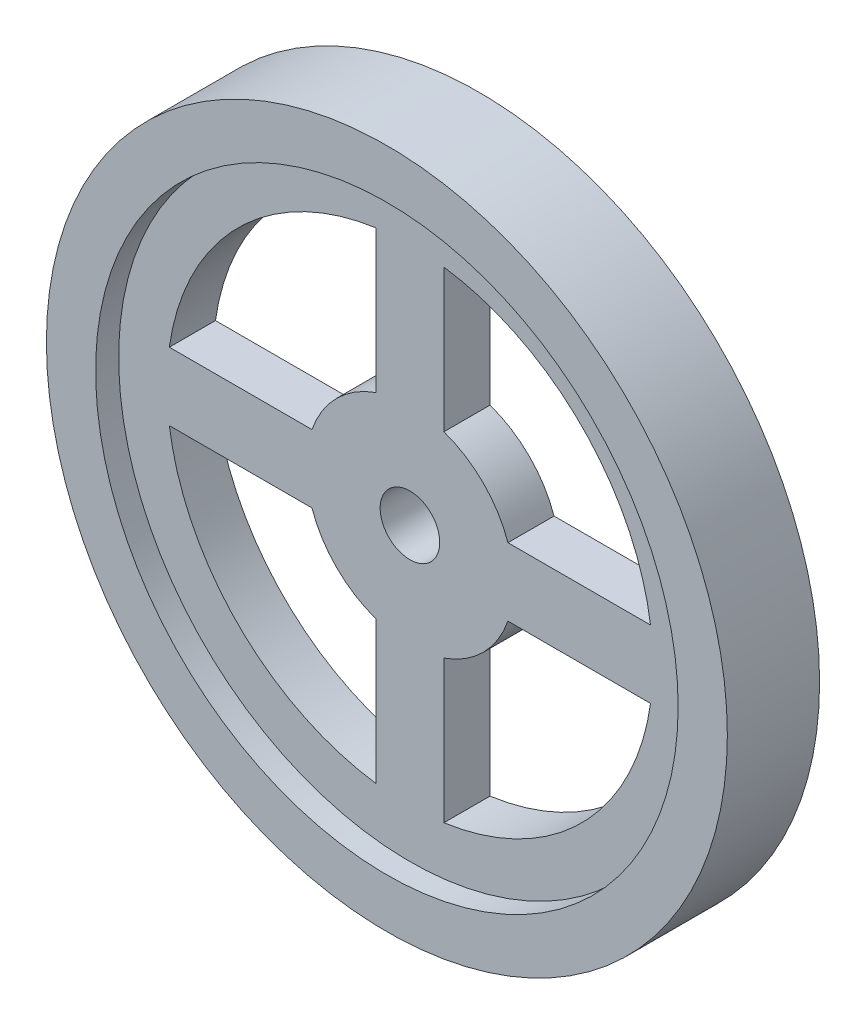
ISO-10303-21;
HEADER;
FILE_DESCRIPTION(('STEP AP214'),'2;1');
FILE_NAME('part.step','',(''),(''),'','','');
FILE_SCHEMA(('AUTOMOTIVE_DESIGN { 1 0 10303 214 1 1 1 1 }'));
ENDSEC;
DATA;
#1=APPLICATION_CONTEXT('core data for automotive mechanical design processes');
#2=APPLICATION_PROTOCOL_DEFINITION('international standard','automotive_design',2000,#1);
#3=PRODUCT_CONTEXT('',#1,'mechanical');
#4=PRODUCT('Part','Part','',(#3));
#5=PRODUCT_RELATED_PRODUCT_CATEGORY('part','',(#4));
#6=PRODUCT_DEFINITION_FORMATION('','',#4);
#7=PRODUCT_DEFINITION_CONTEXT('part definition',#1,'design');
#8=PRODUCT_DEFINITION('design','',#6,#7);
#9=PRODUCT_DEFINITION_SHAPE('','',#8);
#10=(LENGTH_UNIT() NAMED_UNIT(*) SI_UNIT(.MILLI.,.METRE.));
#11=(NAMED_UNIT(*) PLANE_ANGLE_UNIT() SI_UNIT($,.RADIAN.));
#12=(NAMED_UNIT(*) SI_UNIT($,.STERADIAN.) SOLID_ANGLE_UNIT());
#13=UNCERTAINTY_MEASURE_WITH_UNIT(LENGTH_MEASURE(1.E-05),#10,'distance_accuracy_value','');
#14=(GEOMETRIC_REPRESENTATION_CONTEXT(3) GLOBAL_UNCERTAINTY_ASSIGNED_CONTEXT((#13)) GLOBAL_UNIT_ASSIGNED_CONTEXT((#10,
#11,#12)) REPRESENTATION_CONTEXT('',''));
#15=CARTESIAN_POINT('',(0.,0.,0.));
#16=DIRECTION('',(0.,0.,1.));
#17=DIRECTION('',(1.,0.,0.));
#18=AXIS2_PLACEMENT_3D('',#15,#16,#17);
#19=CARTESIAN_POINT('',(0.,0.,0.));
#20=DIRECTION('',(0.,0.,1.));
#21=DIRECTION('',(1.,0.,0.));
#22=AXIS2_PLACEMENT_3D('',#19,#20,#21);
#23=CYLINDRICAL_SURFACE('',#22,32.0812159158557);
#24=CARTESIAN_POINT('',(0.,0.,0.));
#25=DIRECTION('',(0.,0.,1.));
#26=DIRECTION('',(1.,0.,0.));
#27=AXIS2_PLACEMENT_3D('',#24,#25,#26);
#28=CIRCLE('',#27,32.0812159158557);
#29=CARTESIAN_POINT('',(32.0812159158557,0.,0.));
#30=VERTEX_POINT('',#29);
#31=EDGE_CURVE('E240',#30,#30,#28,.T.);
#32=ORIENTED_EDGE('',*,*,#31,.F.);
#33=EDGE_LOOP('',(#32));
#34=FACE_BOUND('',#33,.T.);
#35=CARTESIAN_POINT('',(0.,0.,2.54));
#36=DIRECTION('',(0.,0.,1.));
#37=DIRECTION('',(1.,0.,0.));
#38=AXIS2_PLACEMENT_3D('',#35,#36,#37);
#39=CIRCLE('',#38,32.0812159158557);
#40=CARTESIAN_POINT('',(32.0812159158557,0.,2.54));
#41=VERTEX_POINT('',#40);
#42=EDGE_CURVE('E249',#41,#41,#39,.F.);
#43=ORIENTED_EDGE('',*,*,#42,.F.);
#44=EDGE_LOOP('',(#43));
#45=FACE_BOUND('',#44,.T.);
#46=ADVANCED_FACE('F34',(#34,#45),#23,.F.);
#47=CARTESIAN_POINT('',(0.,0.,10.16));
#48=DIRECTION('',(0.,0.,-1.));
#49=DIRECTION('',(-1.,0.,0.));
#50=AXIS2_PLACEMENT_3D('',#47,#48,#49);
#51=CYLINDRICAL_SURFACE('',#50,37.5);
#52=CARTESIAN_POINT('',(0.,0.,10.16));
#53=DIRECTION('',(0.,0.,1.));
#54=DIRECTION('',(1.,0.,0.));
#55=AXIS2_PLACEMENT_3D('',#52,#53,#54);
#56=CIRCLE('',#55,37.5);
#57=CARTESIAN_POINT('',(37.5,0.,10.16));
#58=VERTEX_POINT('',#57);
#59=EDGE_CURVE('E246',#58,#58,#56,.T.);
#60=ORIENTED_EDGE('',*,*,#59,.F.);
#61=EDGE_LOOP('',(#60));
#62=FACE_BOUND('',#61,.T.);
#63=CARTESIAN_POINT('',(0.,0.,0.));
#64=DIRECTION('',(0.,0.,1.));
#65=DIRECTION('',(1.,0.,0.));
#66=AXIS2_PLACEMENT_3D('',#63,#64,#65);
#67=CIRCLE('',#66,37.5);
#68=CARTESIAN_POINT('',(37.5,0.,0.));
#69=VERTEX_POINT('',#68);
#70=EDGE_CURVE('E243',#69,#69,#67,.T.);
#71=ORIENTED_EDGE('',*,*,#70,.T.);
#72=EDGE_LOOP('',(#71));
#73=FACE_BOUND('',#72,.T.);
#74=ADVANCED_FACE('F36',(#62,#73),#51,.T.);
#75=CARTESIAN_POINT('',(0.,0.,10.16));
#76=DIRECTION('',(0.,0.,1.));
#77=DIRECTION('',(1.,0.,0.));
#78=AXIS2_PLACEMENT_3D('',#75,#76,#77);
#79=PLANE('',#78);
#80=CARTESIAN_POINT('',(0.,0.,10.16));
#81=DIRECTION('',(0.,0.,1.));
#82=DIRECTION('',(1.,0.,0.));
#83=AXIS2_PLACEMENT_3D('',#80,#81,#82);
#84=CIRCLE('',#83,32.0812159158557);
#85=CARTESIAN_POINT('',(32.0812159158557,0.,10.16));
#86=VERTEX_POINT('',#85);
#87=EDGE_CURVE('E239',#86,#86,#84,.T.);
#88=ORIENTED_EDGE('',*,*,#87,.F.);
#89=EDGE_LOOP('',(#88));
#90=FACE_BOUND('',#89,.T.);
#91=ORIENTED_EDGE('',*,*,#59,.T.);
#92=EDGE_LOOP('',(#91));
#93=FACE_BOUND('',#92,.T.);
#94=ADVANCED_FACE('F321',(#90,#93),#79,.T.);
#95=CARTESIAN_POINT('',(0.,0.,0.));
#96=DIRECTION('',(0.,0.,1.));
#97=DIRECTION('',(1.,0.,0.));
#98=AXIS2_PLACEMENT_3D('',#95,#96,#97);
#99=PLANE('',#98);
#100=ORIENTED_EDGE('',*,*,#31,.T.);
#101=EDGE_LOOP('',(#100));
#102=FACE_BOUND('',#101,.T.);
#103=ORIENTED_EDGE('',*,*,#70,.F.);
#104=EDGE_LOOP('',(#103));
#105=FACE_BOUND('',#104,.T.);
#106=ADVANCED_FACE('F328',(#102,#105),#99,.F.);
#107=CARTESIAN_POINT('',(0.,0.,7.62));
#108=DIRECTION('',(0.,0.,1.));
#109=DIRECTION('',(1.,0.,0.));
#110=AXIS2_PLACEMENT_3D('',#107,#108,#109);
#111=CIRCLE('',#110,32.0812159158557);
#112=CARTESIAN_POINT('',(32.0812159158557,0.,7.62));
#113=VERTEX_POINT('',#112);
#114=EDGE_CURVE('E230',#113,#113,#111,.T.);
#115=ORIENTED_EDGE('',*,*,#114,.F.);
#116=EDGE_LOOP('',(#115));
#117=FACE_BOUND('',#116,.T.);
#118=ORIENTED_EDGE('',*,*,#87,.T.);
#119=EDGE_LOOP('',(#118));
#120=FACE_BOUND('',#119,.T.);
#121=ADVANCED_FACE('F317',(#117,#120),#23,.F.);
#122=CARTESIAN_POINT('',(0.,0.,7.62));
#123=DIRECTION('',(0.,0.,1.));
#124=DIRECTION('',(1.,0.,0.));
#125=AXIS2_PLACEMENT_3D('',#122,#123,#124);
#126=PLANE('',#125);
#127=CARTESIAN_POINT('',(0.,0.,7.62));
#128=DIRECTION('',(0.,0.,1.));
#129=DIRECTION('',(1.,0.,0.));
#130=AXIS2_PLACEMENT_3D('',#127,#128,#129);
#131=CIRCLE('',#130,3.28109185483825);
#132=CARTESIAN_POINT('',(3.28109185483825,0.,7.62));
#133=VERTEX_POINT('',#132);
#134=EDGE_CURVE('E540',#133,#133,#131,.T.);
#135=ORIENTED_EDGE('',*,*,#134,.F.);
#136=EDGE_LOOP('',(#135));
#137=FACE_BOUND('',#136,.T.);
#138=CARTESIAN_POINT('',(0.,0.,7.62));
#139=DIRECTION('',(0.,0.,-1.));
#140=DIRECTION('',(1.,0.,0.));
#141=AXIS2_PLACEMENT_3D('',#138,#139,#140);
#142=CIRCLE('',#141,11.4212397193329);
#143=CARTESIAN_POINT('',(-3.73892660911455,-10.7919018035804,7.62));
#144=VERTEX_POINT('',#143);
#145=CARTESIAN_POINT('',(-10.7919018035805,-3.73892660911436,7.62));
#146=VERTEX_POINT('',#145);
#147=EDGE_CURVE('E50',#144,#146,#142,.T.);
#148=ORIENTED_EDGE('',*,*,#147,.F.);
#149=DIRECTION('',(0.,1.,0.));
#150=VECTOR('',#149,1.);
#151=CARTESIAN_POINT('',(-3.73892660911455,-10.7919018035804,7.62));
#152=LINE('',#151,#150);
#153=CARTESIAN_POINT('',(-3.73892660911466,-26.5003300597349,7.62));
#154=VERTEX_POINT('',#153);
#155=EDGE_CURVE('E167',#154,#144,#152,.T.);
#156=ORIENTED_EDGE('',*,*,#155,.F.);
#157=CARTESIAN_POINT('',(0.,0.,7.62));
#158=DIRECTION('',(0.,0.,1.));
#159=DIRECTION('',(1.,0.,0.));
#160=AXIS2_PLACEMENT_3D('',#157,#158,#159);
#161=CIRCLE('',#160,26.7627925572657);
#162=CARTESIAN_POINT('',(-26.500330059735,-3.73892660911419,7.62));
#163=VERTEX_POINT('',#162);
#164=EDGE_CURVE('E151',#163,#154,#161,.T.);
#165=ORIENTED_EDGE('',*,*,#164,.F.);
#166=DIRECTION('',(-1.,0.,0.));
#167=VECTOR('',#166,1.);
#168=CARTESIAN_POINT('',(-10.7919018035805,-3.73892660911436,7.62));
#169=LINE('',#168,#167);
#170=EDGE_CURVE('E160',#146,#163,#169,.T.);
#171=ORIENTED_EDGE('',*,*,#170,.F.);
#172=EDGE_LOOP('',(#148,#156,#165,#171));
#173=FACE_BOUND('',#172,.T.);
#174=CARTESIAN_POINT('',(0.,0.,7.62));
#175=DIRECTION('',(0.,0.,-1.));
#176=DIRECTION('',(1.,0.,0.));
#177=AXIS2_PLACEMENT_3D('',#174,#175,#176);
#178=CIRCLE('',#177,11.4212397193329);
#179=CARTESIAN_POINT('',(10.7919018035804,-3.73892660911451,7.62));
#180=VERTEX_POINT('',#179);
#181=CARTESIAN_POINT('',(3.7389266091144,-10.7919018035805,7.62));
#182=VERTEX_POINT('',#181);
#183=EDGE_CURVE('E174',#180,#182,#178,.T.);
#184=ORIENTED_EDGE('',*,*,#183,.F.);
#185=DIRECTION('',(-1.,0.,0.));
#186=VECTOR('',#185,1.);
#187=CARTESIAN_POINT('',(10.7919018035804,-3.73892660911451,7.62));
#188=LINE('',#187,#186);
#189=CARTESIAN_POINT('',(26.5003300597349,-3.73892660911456,7.62));
#190=VERTEX_POINT('',#189);
#191=EDGE_CURVE('E184',#190,#180,#188,.T.);
#192=ORIENTED_EDGE('',*,*,#191,.F.);
#193=CARTESIAN_POINT('',(0.,0.,7.62));
#194=DIRECTION('',(0.,0.,1.));
#195=DIRECTION('',(1.,0.,0.));
#196=AXIS2_PLACEMENT_3D('',#193,#194,#195);
#197=CIRCLE('',#196,26.7627925572657);
#198=CARTESIAN_POINT('',(3.73892660911427,-26.500330059735,7.62));
#199=VERTEX_POINT('',#198);
#200=EDGE_CURVE('E181',#199,#190,#197,.T.);
#201=ORIENTED_EDGE('',*,*,#200,.F.);
#202=DIRECTION('',(0.,-1.,0.));
#203=VECTOR('',#202,1.);
#204=CARTESIAN_POINT('',(3.7389266091144,-10.7919018035805,7.62));
#205=LINE('',#204,#203);
#206=EDGE_CURVE('E178',#182,#199,#205,.T.);
#207=ORIENTED_EDGE('',*,*,#206,.F.);
#208=EDGE_LOOP('',(#184,#192,#201,#207));
#209=FACE_BOUND('',#208,.T.);
#210=CARTESIAN_POINT('',(0.,0.,7.62));
#211=DIRECTION('',(0.,0.,-1.));
#212=DIRECTION('',(1.,0.,0.));
#213=AXIS2_PLACEMENT_3D('',#210,#211,#212);
#214=CIRCLE('',#213,11.4212397193329);
#215=CARTESIAN_POINT('',(3.73892660911447,10.7919018035804,7.62));
#216=VERTEX_POINT('',#215);
#217=CARTESIAN_POINT('',(10.7919018035805,3.73892660911444,7.62));
#218=VERTEX_POINT('',#217);
#219=EDGE_CURVE('E190',#216,#218,#214,.T.);
#220=ORIENTED_EDGE('',*,*,#219,.F.);
#221=DIRECTION('',(0.,-1.,0.));
#222=VECTOR('',#221,1.);
#223=CARTESIAN_POINT('',(3.73892660911447,10.7919018035804,7.62));
#224=LINE('',#223,#222);
#225=CARTESIAN_POINT('',(3.73892660911447,26.500330059735,7.62));
#226=VERTEX_POINT('',#225);
#227=EDGE_CURVE('E204',#226,#216,#224,.T.);
#228=ORIENTED_EDGE('',*,*,#227,.F.);
#229=CARTESIAN_POINT('',(0.,0.,7.62));
#230=DIRECTION('',(0.,0.,1.));
#231=DIRECTION('',(1.,0.,0.));
#232=AXIS2_PLACEMENT_3D('',#229,#230,#231);
#233=CIRCLE('',#232,26.7627925572657);
#234=CARTESIAN_POINT('',(26.500330059735,3.73892660911438,7.62));
#235=VERTEX_POINT('',#234);
#236=EDGE_CURVE('E201',#235,#226,#233,.T.);
#237=ORIENTED_EDGE('',*,*,#236,.F.);
#238=DIRECTION('',(1.,0.,0.));
#239=VECTOR('',#238,1.);
#240=CARTESIAN_POINT('',(10.7919018035805,3.73892660911444,7.62));
#241=LINE('',#240,#239);
#242=EDGE_CURVE('E198',#218,#235,#241,.T.);
#243=ORIENTED_EDGE('',*,*,#242,.F.);
#244=EDGE_LOOP('',(#220,#228,#237,#243));
#245=FACE_BOUND('',#244,.T.);
#246=CARTESIAN_POINT('',(0.,0.,7.62));
#247=DIRECTION('',(0.,0.,-1.));
#248=DIRECTION('',(1.,0.,0.));
#249=AXIS2_PLACEMENT_3D('',#246,#247,#248);
#250=CIRCLE('',#249,11.4212397193329);
#251=CARTESIAN_POINT('',(-10.7919018035804,3.73892660911459,7.62));
#252=VERTEX_POINT('',#251);
#253=CARTESIAN_POINT('',(-3.73892660911447,10.7919018035804,7.62));
#254=VERTEX_POINT('',#253);
#255=EDGE_CURVE('E210',#252,#254,#250,.T.);
#256=ORIENTED_EDGE('',*,*,#255,.F.);
#257=DIRECTION('',(1.,0.,0.));
#258=VECTOR('',#257,1.);
#259=CARTESIAN_POINT('',(-10.7919018035804,3.73892660911459,7.62));
#260=LINE('',#259,#258);
#261=CARTESIAN_POINT('',(-26.5003300597349,3.73892660911475,7.62));
#262=VERTEX_POINT('',#261);
#263=EDGE_CURVE('E224',#262,#252,#260,.T.);
#264=ORIENTED_EDGE('',*,*,#263,.F.);
#265=CARTESIAN_POINT('',(0.,0.,7.62));
#266=DIRECTION('',(0.,0.,1.));
#267=DIRECTION('',(1.,0.,0.));
#268=AXIS2_PLACEMENT_3D('',#265,#266,#267);
#269=CIRCLE('',#268,26.7627925572657);
#270=CARTESIAN_POINT('',(-3.73892660911447,26.500330059735,7.62));
#271=VERTEX_POINT('',#270);
#272=EDGE_CURVE('E221',#271,#262,#269,.T.);
#273=ORIENTED_EDGE('',*,*,#272,.F.);
#274=DIRECTION('',(0.,1.,0.));
#275=VECTOR('',#274,1.);
#276=CARTESIAN_POINT('',(-3.73892660911447,10.7919018035804,7.62));
#277=LINE('',#276,#275);
#278=EDGE_CURVE('E218',#254,#271,#277,.T.);
#279=ORIENTED_EDGE('',*,*,#278,.F.);
#280=EDGE_LOOP('',(#256,#264,#273,#279));
#281=FACE_BOUND('',#280,.T.);
#282=ORIENTED_EDGE('',*,*,#114,.T.);
#283=EDGE_LOOP('',(#282));
#284=FACE_BOUND('',#283,.T.);
#285=ADVANCED_FACE('F164',(#137,#173,#209,#245,#281,#284),#126,.T.);
#286=CARTESIAN_POINT('',(0.,0.,2.54));
#287=DIRECTION('',(0.,0.,1.));
#288=DIRECTION('',(1.,0.,0.));
#289=AXIS2_PLACEMENT_3D('',#286,#287,#288);
#290=PLANE('',#289);
#291=CARTESIAN_POINT('',(0.,0.,2.54));
#292=DIRECTION('',(0.,0.,1.));
#293=DIRECTION('',(1.,0.,0.));
#294=AXIS2_PLACEMENT_3D('',#291,#292,#293);
#295=CIRCLE('',#294,3.28109185483825);
#296=CARTESIAN_POINT('',(3.28109185483825,0.,2.54));
#297=VERTEX_POINT('',#296);
#298=EDGE_CURVE('E38',#297,#297,#295,.T.);
#299=ORIENTED_EDGE('',*,*,#298,.T.);
#300=EDGE_LOOP('',(#299));
#301=FACE_BOUND('',#300,.T.);
#302=DIRECTION('',(0.,1.,0.));
#303=VECTOR('',#302,1.);
#304=CARTESIAN_POINT('',(-3.73892660911447,0.,2.54));
#305=LINE('',#304,#303);
#306=CARTESIAN_POINT('',(-3.73892660911466,-26.5003300597349,2.54));
#307=VERTEX_POINT('',#306);
#308=CARTESIAN_POINT('',(-3.73892660911455,-10.7919018035804,2.54));
#309=VERTEX_POINT('',#308);
#310=EDGE_CURVE('E43',#307,#309,#305,.T.);
#311=ORIENTED_EDGE('',*,*,#310,.T.);
#312=CARTESIAN_POINT('',(0.,0.,2.54));
#313=DIRECTION('',(0.,0.,1.));
#314=DIRECTION('',(1.,0.,0.));
#315=AXIS2_PLACEMENT_3D('',#312,#313,#314);
#316=CIRCLE('',#315,11.4212397193329);
#317=CARTESIAN_POINT('',(-10.7919018035805,-3.73892660911436,2.54));
#318=VERTEX_POINT('',#317);
#319=EDGE_CURVE('E11',#309,#318,#316,.F.);
#320=ORIENTED_EDGE('',*,*,#319,.T.);
#321=DIRECTION('',(-1.,0.,0.));
#322=VECTOR('',#321,1.);
#323=CARTESIAN_POINT('',(0.,-3.73892660911447,2.54));
#324=LINE('',#323,#322);
#325=CARTESIAN_POINT('',(-26.500330059735,-3.73892660911419,2.54));
#326=VERTEX_POINT('',#325);
#327=EDGE_CURVE('E290',#318,#326,#324,.T.);
#328=ORIENTED_EDGE('',*,*,#327,.T.);
#329=CARTESIAN_POINT('',(0.,0.,2.54));
#330=DIRECTION('',(0.,0.,1.));
#331=DIRECTION('',(1.,0.,0.));
#332=AXIS2_PLACEMENT_3D('',#329,#330,#331);
#333=CIRCLE('',#332,26.7627925572657);
#334=EDGE_CURVE('E154',#326,#307,#333,.T.);
#335=ORIENTED_EDGE('',*,*,#334,.T.);
#336=EDGE_LOOP('',(#311,#320,#328,#335));
#337=FACE_BOUND('',#336,.T.);
#338=DIRECTION('',(-1.,0.,0.));
#339=VECTOR('',#338,1.);
#340=CARTESIAN_POINT('',(0.,-3.73892660911447,2.54));
#341=LINE('',#340,#339);
#342=CARTESIAN_POINT('',(26.5003300597349,-3.73892660911456,2.54));
#343=VERTEX_POINT('',#342);
#344=CARTESIAN_POINT('',(10.7919018035804,-3.73892660911451,2.54));
#345=VERTEX_POINT('',#344);
#346=EDGE_CURVE('E284',#343,#345,#341,.T.);
#347=ORIENTED_EDGE('',*,*,#346,.T.);
#348=CARTESIAN_POINT('',(0.,0.,2.54));
#349=DIRECTION('',(0.,0.,1.));
#350=DIRECTION('',(1.,0.,0.));
#351=AXIS2_PLACEMENT_3D('',#348,#349,#350);
#352=CIRCLE('',#351,11.4212397193329);
#353=CARTESIAN_POINT('',(3.7389266091144,-10.7919018035805,2.54));
#354=VERTEX_POINT('',#353);
#355=EDGE_CURVE('E287',#345,#354,#352,.F.);
#356=ORIENTED_EDGE('',*,*,#355,.T.);
#357=DIRECTION('',(0.,-1.,0.));
#358=VECTOR('',#357,1.);
#359=CARTESIAN_POINT('',(3.73892660911447,0.,2.54));
#360=LINE('',#359,#358);
#361=CARTESIAN_POINT('',(3.73892660911429,-26.500330059735,2.54));
#362=VERTEX_POINT('',#361);
#363=EDGE_CURVE('E278',#354,#362,#360,.T.);
#364=ORIENTED_EDGE('',*,*,#363,.T.);
#365=CARTESIAN_POINT('',(0.,0.,2.54));
#366=DIRECTION('',(0.,0.,1.));
#367=DIRECTION('',(1.,0.,0.));
#368=AXIS2_PLACEMENT_3D('',#365,#366,#367);
#369=CIRCLE('',#368,26.7627925572657);
#370=EDGE_CURVE('E281',#362,#343,#369,.T.);
#371=ORIENTED_EDGE('',*,*,#370,.T.);
#372=EDGE_LOOP('',(#347,#356,#364,#371));
#373=FACE_BOUND('',#372,.T.);
#374=DIRECTION('',(0.,-1.,0.));
#375=VECTOR('',#374,1.);
#376=CARTESIAN_POINT('',(3.73892660911447,0.,2.54));
#377=LINE('',#376,#375);
#378=CARTESIAN_POINT('',(3.73892660911447,26.500330059735,2.54));
#379=VERTEX_POINT('',#378);
#380=CARTESIAN_POINT('',(3.73892660911447,10.7919018035804,2.54));
#381=VERTEX_POINT('',#380);
#382=EDGE_CURVE('E272',#379,#381,#377,.T.);
#383=ORIENTED_EDGE('',*,*,#382,.T.);
#384=CARTESIAN_POINT('',(0.,0.,2.54));
#385=DIRECTION('',(0.,0.,1.));
#386=DIRECTION('',(1.,0.,0.));
#387=AXIS2_PLACEMENT_3D('',#384,#385,#386);
#388=CIRCLE('',#387,11.4212397193329);
#389=CARTESIAN_POINT('',(10.7919018035805,3.73892660911444,2.54));
#390=VERTEX_POINT('',#389);
#391=EDGE_CURVE('E275',#381,#390,#388,.F.);
#392=ORIENTED_EDGE('',*,*,#391,.T.);
#393=DIRECTION('',(1.,0.,0.));
#394=VECTOR('',#393,1.);
#395=CARTESIAN_POINT('',(0.,3.73892660911447,2.54));
#396=LINE('',#395,#394);
#397=CARTESIAN_POINT('',(26.500330059735,3.73892660911438,2.54));
#398=VERTEX_POINT('',#397);
#399=EDGE_CURVE('E266',#390,#398,#396,.T.);
#400=ORIENTED_EDGE('',*,*,#399,.T.);
#401=CARTESIAN_POINT('',(0.,0.,2.54));
#402=DIRECTION('',(0.,0.,1.));
#403=DIRECTION('',(1.,0.,0.));
#404=AXIS2_PLACEMENT_3D('',#401,#402,#403);
#405=CIRCLE('',#404,26.7627925572657);
#406=EDGE_CURVE('E269',#398,#379,#405,.T.);
#407=ORIENTED_EDGE('',*,*,#406,.T.);
#408=EDGE_LOOP('',(#383,#392,#400,#407));
#409=FACE_BOUND('',#408,.T.);
#410=DIRECTION('',(1.,0.,0.));
#411=VECTOR('',#410,1.);
#412=CARTESIAN_POINT('',(0.,3.73892660911447,2.54));
#413=LINE('',#412,#411);
#414=CARTESIAN_POINT('',(-26.5003300597349,3.73892660911475,2.54));
#415=VERTEX_POINT('',#414);
#416=CARTESIAN_POINT('',(-10.7919018035804,3.73892660911459,2.54));
#417=VERTEX_POINT('',#416);
#418=EDGE_CURVE('E260',#415,#417,#413,.T.);
#419=ORIENTED_EDGE('',*,*,#418,.T.);
#420=CARTESIAN_POINT('',(0.,0.,2.54));
#421=DIRECTION('',(0.,0.,1.));
#422=DIRECTION('',(1.,0.,0.));
#423=AXIS2_PLACEMENT_3D('',#420,#421,#422);
#424=CIRCLE('',#423,11.4212397193329);
#425=CARTESIAN_POINT('',(-3.73892660911447,10.7919018035804,2.54));
#426=VERTEX_POINT('',#425);
#427=EDGE_CURVE('E263',#417,#426,#424,.F.);
#428=ORIENTED_EDGE('',*,*,#427,.T.);
#429=DIRECTION('',(0.,1.,0.));
#430=VECTOR('',#429,1.);
#431=CARTESIAN_POINT('',(-3.73892660911447,0.,2.54));
#432=LINE('',#431,#430);
#433=CARTESIAN_POINT('',(-3.73892660911447,26.500330059735,2.54));
#434=VERTEX_POINT('',#433);
#435=EDGE_CURVE('E254',#426,#434,#432,.T.);
#436=ORIENTED_EDGE('',*,*,#435,.T.);
#437=CARTESIAN_POINT('',(0.,0.,2.54));
#438=DIRECTION('',(0.,0.,1.));
#439=DIRECTION('',(1.,0.,0.));
#440=AXIS2_PLACEMENT_3D('',#437,#438,#439);
#441=CIRCLE('',#440,26.7627925572657);
#442=EDGE_CURVE('E257',#434,#415,#441,.T.);
#443=ORIENTED_EDGE('',*,*,#442,.T.);
#444=EDGE_LOOP('',(#419,#428,#436,#443));
#445=FACE_BOUND('',#444,.T.);
#446=ORIENTED_EDGE('',*,*,#42,.T.);
#447=EDGE_LOOP('',(#446));
#448=FACE_BOUND('',#447,.T.);
#449=ADVANCED_FACE('F295',(#301,#337,#373,#409,#445,#448),#290,.F.);
#450=CARTESIAN_POINT('',(0.,0.,-7.62));
#451=DIRECTION('',(0.,0.,1.));
#452=DIRECTION('',(1.,0.,0.));
#453=AXIS2_PLACEMENT_3D('',#450,#451,#452);
#454=CYLINDRICAL_SURFACE('',#453,11.4212397193329);
#455=DIRECTION('',(0.,0.,1.));
#456=VECTOR('',#455,1.);
#457=CARTESIAN_POINT('',(-10.7919018035804,3.73892660911459,-7.62));
#458=LINE('',#457,#456);
#459=EDGE_CURVE('E228',#417,#252,#458,.T.);
#460=ORIENTED_EDGE('',*,*,#459,.T.);
#461=ORIENTED_EDGE('',*,*,#255,.T.);
#462=DIRECTION('',(0.,0.,1.));
#463=VECTOR('',#462,1.);
#464=CARTESIAN_POINT('',(-3.73892660911447,10.7919018035804,-7.62));
#465=LINE('',#464,#463);
#466=EDGE_CURVE('E227',#426,#254,#465,.T.);
#467=ORIENTED_EDGE('',*,*,#466,.F.);
#468=ORIENTED_EDGE('',*,*,#427,.F.);
#469=EDGE_LOOP('',(#460,#461,#467,#468));
#470=FACE_BOUND('',#469,.T.);
#471=ADVANCED_FACE('F373',(#470),#454,.T.);
#472=CARTESIAN_POINT('',(-10.7919018035804,3.73892660911459,-7.62));
#473=DIRECTION('',(0.,-1.,0.));
#474=DIRECTION('',(1.,0.,0.));
#475=AXIS2_PLACEMENT_3D('',#472,#473,#474);
#476=PLANE('',#475);
#477=DIRECTION('',(0.,0.,1.));
#478=VECTOR('',#477,1.);
#479=CARTESIAN_POINT('',(-26.5003300597349,3.73892660911475,-7.62));
#480=LINE('',#479,#478);
#481=EDGE_CURVE('E231',#415,#262,#480,.T.);
#482=ORIENTED_EDGE('',*,*,#481,.T.);
#483=ORIENTED_EDGE('',*,*,#263,.T.);
#484=ORIENTED_EDGE('',*,*,#459,.F.);
#485=ORIENTED_EDGE('',*,*,#418,.F.);
#486=EDGE_LOOP('',(#482,#483,#484,#485));
#487=FACE_BOUND('',#486,.T.);
#488=ADVANCED_FACE('F378',(#487),#476,.F.);
#489=CARTESIAN_POINT('',(0.,0.,-7.62));
#490=DIRECTION('',(0.,0.,1.));
#491=DIRECTION('',(1.,0.,0.));
#492=AXIS2_PLACEMENT_3D('',#489,#490,#491);
#493=CYLINDRICAL_SURFACE('',#492,26.7627925572657);
#494=DIRECTION('',(0.,0.,1.));
#495=VECTOR('',#494,1.);
#496=CARTESIAN_POINT('',(-3.73892660911447,26.500330059735,-7.62));
#497=LINE('',#496,#495);
#498=EDGE_CURVE('E233',#434,#271,#497,.T.);
#499=ORIENTED_EDGE('',*,*,#498,.T.);
#500=ORIENTED_EDGE('',*,*,#272,.T.);
#501=ORIENTED_EDGE('',*,*,#481,.F.);
#502=ORIENTED_EDGE('',*,*,#442,.F.);
#503=EDGE_LOOP('',(#499,#500,#501,#502));
#504=FACE_BOUND('',#503,.T.);
#505=ADVANCED_FACE('F390',(#504),#493,.F.);
#506=CARTESIAN_POINT('',(-3.73892660911447,10.7919018035804,-7.62));
#507=DIRECTION('',(1.,0.,0.));
#508=DIRECTION('',(0.,0.,-1.));
#509=AXIS2_PLACEMENT_3D('',#506,#507,#508);
#510=PLANE('',#509);
#511=ORIENTED_EDGE('',*,*,#466,.T.);
#512=ORIENTED_EDGE('',*,*,#278,.T.);
#513=ORIENTED_EDGE('',*,*,#498,.F.);
#514=ORIENTED_EDGE('',*,*,#435,.F.);
#515=EDGE_LOOP('',(#511,#512,#513,#514));
#516=FACE_BOUND('',#515,.T.);
#517=ADVANCED_FACE('F400',(#516),#510,.F.);
#518=CARTESIAN_POINT('',(0.,0.,-7.62));
#519=DIRECTION('',(0.,0.,1.));
#520=DIRECTION('',(1.,0.,0.));
#521=AXIS2_PLACEMENT_3D('',#518,#519,#520);
#522=CYLINDRICAL_SURFACE('',#521,11.4212397193329);
#523=DIRECTION('',(0.,0.,1.));
#524=VECTOR('',#523,1.);
#525=CARTESIAN_POINT('',(3.73892660911447,10.7919018035804,-7.62));
#526=LINE('',#525,#524);
#527=EDGE_CURVE('E208',#381,#216,#526,.T.);
#528=ORIENTED_EDGE('',*,*,#527,.T.);
#529=ORIENTED_EDGE('',*,*,#219,.T.);
#530=DIRECTION('',(0.,0.,1.));
#531=VECTOR('',#530,1.);
#532=CARTESIAN_POINT('',(10.7919018035805,3.73892660911444,-7.62));
#533=LINE('',#532,#531);
#534=EDGE_CURVE('E207',#390,#218,#533,.T.);
#535=ORIENTED_EDGE('',*,*,#534,.F.);
#536=ORIENTED_EDGE('',*,*,#391,.F.);
#537=EDGE_LOOP('',(#528,#529,#535,#536));
#538=FACE_BOUND('',#537,.T.);
#539=ADVANCED_FACE('F410',(#538),#522,.T.);
#540=CARTESIAN_POINT('',(3.73892660911447,10.7919018035804,-7.62));
#541=DIRECTION('',(-1.,0.,0.));
#542=DIRECTION('',(0.,0.,1.));
#543=AXIS2_PLACEMENT_3D('',#540,#541,#542);
#544=PLANE('',#543);
#545=DIRECTION('',(0.,0.,1.));
#546=VECTOR('',#545,1.);
#547=CARTESIAN_POINT('',(3.73892660911447,26.500330059735,-7.62));
#548=LINE('',#547,#546);
#549=EDGE_CURVE('E211',#379,#226,#548,.T.);
#550=ORIENTED_EDGE('',*,*,#549,.T.);
#551=ORIENTED_EDGE('',*,*,#227,.T.);
#552=ORIENTED_EDGE('',*,*,#527,.F.);
#553=ORIENTED_EDGE('',*,*,#382,.F.);
#554=EDGE_LOOP('',(#550,#551,#552,#553));
#555=FACE_BOUND('',#554,.T.);
#556=ADVANCED_FACE('F420',(#555),#544,.F.);
#557=CARTESIAN_POINT('',(0.,0.,-7.62));
#558=DIRECTION('',(0.,0.,1.));
#559=DIRECTION('',(1.,0.,0.));
#560=AXIS2_PLACEMENT_3D('',#557,#558,#559);
#561=CYLINDRICAL_SURFACE('',#560,26.7627925572657);
#562=DIRECTION('',(0.,0.,1.));
#563=VECTOR('',#562,1.);
#564=CARTESIAN_POINT('',(26.500330059735,3.73892660911438,-7.62));
#565=LINE('',#564,#563);
#566=EDGE_CURVE('E213',#398,#235,#565,.T.);
#567=ORIENTED_EDGE('',*,*,#566,.T.);
#568=ORIENTED_EDGE('',*,*,#236,.T.);
#569=ORIENTED_EDGE('',*,*,#549,.F.);
#570=ORIENTED_EDGE('',*,*,#406,.F.);
#571=EDGE_LOOP('',(#567,#568,#569,#570));
#572=FACE_BOUND('',#571,.T.);
#573=ADVANCED_FACE('F430',(#572),#561,.F.);
#574=CARTESIAN_POINT('',(10.7919018035805,3.73892660911444,-7.62));
#575=DIRECTION('',(0.,-1.,0.));
#576=DIRECTION('',(1.,0.,0.));
#577=AXIS2_PLACEMENT_3D('',#574,#575,#576);
#578=PLANE('',#577);
#579=ORIENTED_EDGE('',*,*,#534,.T.);
#580=ORIENTED_EDGE('',*,*,#242,.T.);
#581=ORIENTED_EDGE('',*,*,#566,.F.);
#582=ORIENTED_EDGE('',*,*,#399,.F.);
#583=EDGE_LOOP('',(#579,#580,#581,#582));
#584=FACE_BOUND('',#583,.T.);
#585=ADVANCED_FACE('F440',(#584),#578,.F.);
#586=CARTESIAN_POINT('',(0.,0.,-7.62));
#587=DIRECTION('',(0.,0.,1.));
#588=DIRECTION('',(1.,0.,0.));
#589=AXIS2_PLACEMENT_3D('',#586,#587,#588);
#590=CYLINDRICAL_SURFACE('',#589,11.4212397193329);
#591=DIRECTION('',(0.,0.,1.));
#592=VECTOR('',#591,1.);
#593=CARTESIAN_POINT('',(10.7919018035804,-3.73892660911451,-7.62));
#594=LINE('',#593,#592);
#595=EDGE_CURVE('E188',#345,#180,#594,.T.);
#596=ORIENTED_EDGE('',*,*,#595,.T.);
#597=ORIENTED_EDGE('',*,*,#183,.T.);
#598=DIRECTION('',(0.,0.,1.));
#599=VECTOR('',#598,1.);
#600=CARTESIAN_POINT('',(3.7389266091144,-10.7919018035805,-7.62));
#601=LINE('',#600,#599);
#602=EDGE_CURVE('E187',#354,#182,#601,.T.);
#603=ORIENTED_EDGE('',*,*,#602,.F.);
#604=ORIENTED_EDGE('',*,*,#355,.F.);
#605=EDGE_LOOP('',(#596,#597,#603,#604));
#606=FACE_BOUND('',#605,.T.);
#607=ADVANCED_FACE('F450',(#606),#590,.T.);
#608=CARTESIAN_POINT('',(10.7919018035804,-3.73892660911451,-7.62));
#609=DIRECTION('',(0.,1.,0.));
#610=DIRECTION('',(-1.,0.,0.));
#611=AXIS2_PLACEMENT_3D('',#608,#609,#610);
#612=PLANE('',#611);
#613=DIRECTION('',(0.,0.,1.));
#614=VECTOR('',#613,1.);
#615=CARTESIAN_POINT('',(26.5003300597349,-3.73892660911456,-7.62));
#616=LINE('',#615,#614);
#617=EDGE_CURVE('E191',#343,#190,#616,.T.);
#618=ORIENTED_EDGE('',*,*,#617,.T.);
#619=ORIENTED_EDGE('',*,*,#191,.T.);
#620=ORIENTED_EDGE('',*,*,#595,.F.);
#621=ORIENTED_EDGE('',*,*,#346,.F.);
#622=EDGE_LOOP('',(#618,#619,#620,#621));
#623=FACE_BOUND('',#622,.T.);
#624=ADVANCED_FACE('F460',(#623),#612,.F.);
#625=CARTESIAN_POINT('',(0.,0.,-7.62));
#626=DIRECTION('',(0.,0.,1.));
#627=DIRECTION('',(1.,0.,0.));
#628=AXIS2_PLACEMENT_3D('',#625,#626,#627);
#629=CYLINDRICAL_SURFACE('',#628,26.7627925572657);
#630=DIRECTION('',(0.,0.,1.));
#631=VECTOR('',#630,1.);
#632=CARTESIAN_POINT('',(3.73892660911427,-26.500330059735,-7.62));
#633=LINE('',#632,#631);
#634=EDGE_CURVE('E193',#362,#199,#633,.T.);
#635=ORIENTED_EDGE('',*,*,#634,.T.);
#636=ORIENTED_EDGE('',*,*,#200,.T.);
#637=ORIENTED_EDGE('',*,*,#617,.F.);
#638=ORIENTED_EDGE('',*,*,#370,.F.);
#639=EDGE_LOOP('',(#635,#636,#637,#638));
#640=FACE_BOUND('',#639,.T.);
#641=ADVANCED_FACE('F309',(#640),#629,.F.);
#642=CARTESIAN_POINT('',(3.7389266091144,-10.7919018035805,-7.62));
#643=DIRECTION('',(-1.,0.,0.));
#644=DIRECTION('',(0.,-1.,0.));
#645=AXIS2_PLACEMENT_3D('',#642,#643,#644);
#646=PLANE('',#645);
#647=ORIENTED_EDGE('',*,*,#602,.T.);
#648=ORIENTED_EDGE('',*,*,#206,.T.);
#649=ORIENTED_EDGE('',*,*,#634,.F.);
#650=ORIENTED_EDGE('',*,*,#363,.F.);
#651=EDGE_LOOP('',(#647,#648,#649,#650));
#652=FACE_BOUND('',#651,.T.);
#653=ADVANCED_FACE('F302',(#652),#646,.F.);
#654=CARTESIAN_POINT('',(0.,0.,-7.62));
#655=DIRECTION('',(0.,0.,1.));
#656=DIRECTION('',(1.,0.,0.));
#657=AXIS2_PLACEMENT_3D('',#654,#655,#656);
#658=CYLINDRICAL_SURFACE('',#657,11.4212397193329);
#659=DIRECTION('',(0.,0.,1.));
#660=VECTOR('',#659,1.);
#661=CARTESIAN_POINT('',(-3.73892660911455,-10.7919018035804,-7.62));
#662=LINE('',#661,#660);
#663=EDGE_CURVE('E172',#309,#144,#662,.T.);
#664=ORIENTED_EDGE('',*,*,#663,.T.);
#665=ORIENTED_EDGE('',*,*,#147,.T.);
#666=DIRECTION('',(0.,0.,1.));
#667=VECTOR('',#666,1.);
#668=CARTESIAN_POINT('',(-10.7919018035805,-3.73892660911436,-7.62));
#669=LINE('',#668,#667);
#670=EDGE_CURVE('E157',#318,#146,#669,.T.);
#671=ORIENTED_EDGE('',*,*,#670,.F.);
#672=ORIENTED_EDGE('',*,*,#319,.F.);
#673=EDGE_LOOP('',(#664,#665,#671,#672));
#674=FACE_BOUND('',#673,.T.);
#675=ADVANCED_FACE('F300',(#674),#658,.T.);
#676=CARTESIAN_POINT('',(-3.73892660911455,-10.7919018035804,-7.62));
#677=DIRECTION('',(1.,0.,0.));
#678=DIRECTION('',(0.,1.,0.));
#679=AXIS2_PLACEMENT_3D('',#676,#677,#678);
#680=PLANE('',#679);
#681=DIRECTION('',(0.,0.,1.));
#682=VECTOR('',#681,1.);
#683=CARTESIAN_POINT('',(-3.73892660911466,-26.5003300597349,-7.62));
#684=LINE('',#683,#682);
#685=EDGE_CURVE('E156',#307,#154,#684,.T.);
#686=ORIENTED_EDGE('',*,*,#685,.T.);
#687=ORIENTED_EDGE('',*,*,#155,.T.);
#688=ORIENTED_EDGE('',*,*,#663,.F.);
#689=ORIENTED_EDGE('',*,*,#310,.F.);
#690=EDGE_LOOP('',(#686,#687,#688,#689));
#691=FACE_BOUND('',#690,.T.);
#692=ADVANCED_FACE('F299',(#691),#680,.F.);
#693=CARTESIAN_POINT('',(0.,0.,-7.62));
#694=DIRECTION('',(0.,0.,1.));
#695=DIRECTION('',(1.,0.,0.));
#696=AXIS2_PLACEMENT_3D('',#693,#694,#695);
#697=CYLINDRICAL_SURFACE('',#696,26.7627925572657);
#698=DIRECTION('',(0.,0.,1.));
#699=VECTOR('',#698,1.);
#700=CARTESIAN_POINT('',(-26.500330059735,-3.73892660911419,-7.62));
#701=LINE('',#700,#699);
#702=EDGE_CURVE('E58',#326,#163,#701,.T.);
#703=ORIENTED_EDGE('',*,*,#702,.T.);
#704=ORIENTED_EDGE('',*,*,#164,.T.);
#705=ORIENTED_EDGE('',*,*,#685,.F.);
#706=ORIENTED_EDGE('',*,*,#334,.F.);
#707=EDGE_LOOP('',(#703,#704,#705,#706));
#708=FACE_BOUND('',#707,.T.);
#709=ADVANCED_FACE('F148',(#708),#697,.F.);
#710=CARTESIAN_POINT('',(-10.7919018035805,-3.73892660911436,-7.62));
#711=DIRECTION('',(0.,1.,0.));
#712=DIRECTION('',(-1.,0.,0.));
#713=AXIS2_PLACEMENT_3D('',#710,#711,#712);
#714=PLANE('',#713);
#715=ORIENTED_EDGE('',*,*,#670,.T.);
#716=ORIENTED_EDGE('',*,*,#170,.T.);
#717=ORIENTED_EDGE('',*,*,#702,.F.);
#718=ORIENTED_EDGE('',*,*,#327,.F.);
#719=EDGE_LOOP('',(#715,#716,#717,#718));
#720=FACE_BOUND('',#719,.T.);
#721=ADVANCED_FACE('F161',(#720),#714,.F.);
#722=CARTESIAN_POINT('',(0.,0.,-7.62));
#723=DIRECTION('',(0.,0.,1.));
#724=DIRECTION('',(1.,0.,0.));
#725=AXIS2_PLACEMENT_3D('',#722,#723,#724);
#726=CYLINDRICAL_SURFACE('',#725,3.28109185483825);
#727=ORIENTED_EDGE('',*,*,#134,.T.);
#728=EDGE_LOOP('',(#727));
#729=FACE_BOUND('',#728,.T.);
#730=ORIENTED_EDGE('',*,*,#298,.F.);
#731=EDGE_LOOP('',(#730));
#732=FACE_BOUND('',#731,.T.);
#733=ADVANCED_FACE('F511',(#729,#732),#726,.F.);
#734=CLOSED_SHELL('',(#46,#74,#94,#106,#121,#285,#449,#471,#488,#505,#517,#539,#556,#573,#585,
#607,#624,#641,#653,#675,#692,#709,#721,#733));
#735=MANIFOLD_SOLID_BREP('B2',#734);
#736=ADVANCED_BREP_SHAPE_REPRESENTATION('',(#18,#735),#14);
#737=SHAPE_DEFINITION_REPRESENTATION(#9,#736);
ENDSEC;
END-ISO-10303-21;
